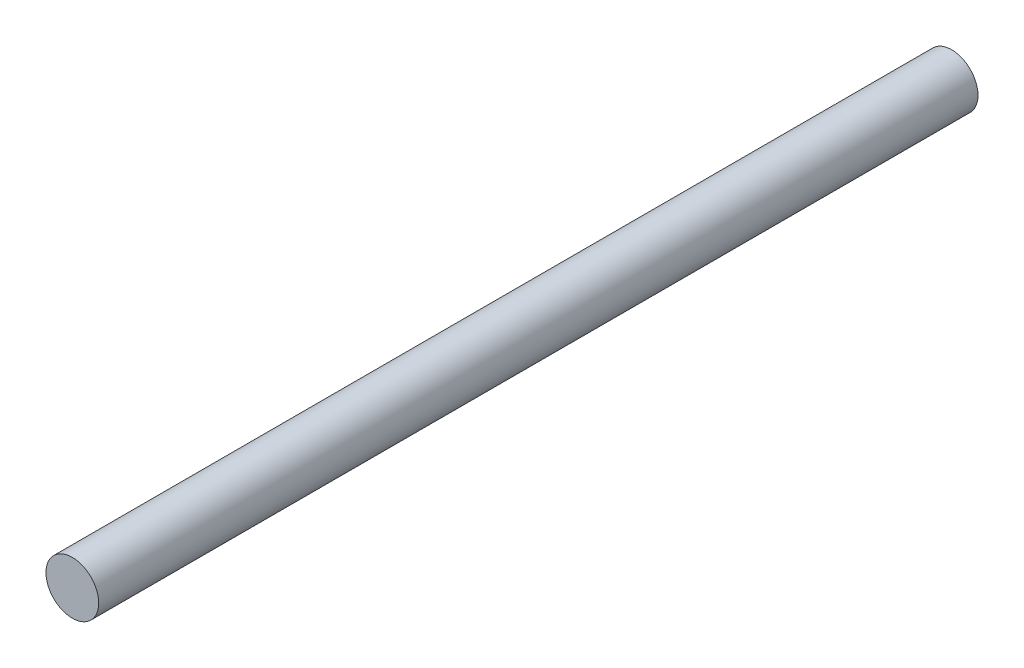
ISO-10303-21;
HEADER;
FILE_DESCRIPTION(('STEP AP214'),'2;1');
FILE_NAME('part.step','',(''),(''),'','','');
FILE_SCHEMA(('AUTOMOTIVE_DESIGN { 1 0 10303 214 1 1 1 1 }'));
ENDSEC;
DATA;
#1=APPLICATION_CONTEXT('core data for automotive mechanical design processes');
#2=APPLICATION_PROTOCOL_DEFINITION('international standard','automotive_design',2000,#1);
#3=PRODUCT_CONTEXT('',#1,'mechanical');
#4=PRODUCT('Part','Part','',(#3));
#5=PRODUCT_RELATED_PRODUCT_CATEGORY('part','',(#4));
#6=PRODUCT_DEFINITION_FORMATION('','',#4);
#7=PRODUCT_DEFINITION_CONTEXT('part definition',#1,'design');
#8=PRODUCT_DEFINITION('design','',#6,#7);
#9=PRODUCT_DEFINITION_SHAPE('','',#8);
#10=(LENGTH_UNIT() NAMED_UNIT(*) SI_UNIT(.MILLI.,.METRE.));
#11=(NAMED_UNIT(*) PLANE_ANGLE_UNIT() SI_UNIT($,.RADIAN.));
#12=(NAMED_UNIT(*) SI_UNIT($,.STERADIAN.) SOLID_ANGLE_UNIT());
#13=UNCERTAINTY_MEASURE_WITH_UNIT(LENGTH_MEASURE(1.E-05),#10,'distance_accuracy_value','');
#14=(GEOMETRIC_REPRESENTATION_CONTEXT(3) GLOBAL_UNCERTAINTY_ASSIGNED_CONTEXT((#13)) GLOBAL_UNIT_ASSIGNED_CONTEXT((#10,
#11,#12)) REPRESENTATION_CONTEXT('',''));
#15=CARTESIAN_POINT('',(0.,0.,0.));
#16=DIRECTION('',(0.,0.,1.));
#17=DIRECTION('',(1.,0.,0.));
#18=AXIS2_PLACEMENT_3D('',#15,#16,#17);
#19=CARTESIAN_POINT('',(0.,0.,500.));
#20=DIRECTION('',(0.,0.,-1.));
#21=DIRECTION('',(-1.,0.,0.));
#22=AXIS2_PLACEMENT_3D('',#19,#20,#21);
#23=CYLINDRICAL_SURFACE('',#22,15.);
#24=CARTESIAN_POINT('',(0.,0.,500.));
#25=DIRECTION('',(0.,0.,1.));
#26=DIRECTION('',(1.,0.,0.));
#27=AXIS2_PLACEMENT_3D('',#24,#25,#26);
#28=CIRCLE('',#27,15.);
#29=CARTESIAN_POINT('',(15.,0.,500.));
#30=VERTEX_POINT('',#29);
#31=EDGE_CURVE('E10',#30,#30,#28,.T.);
#32=ORIENTED_EDGE('',*,*,#31,.F.);
#33=EDGE_LOOP('',(#32));
#34=FACE_BOUND('',#33,.T.);
#35=CARTESIAN_POINT('',(0.,0.,0.));
#36=DIRECTION('',(0.,0.,1.));
#37=DIRECTION('',(1.,0.,0.));
#38=AXIS2_PLACEMENT_3D('',#35,#36,#37);
#39=CIRCLE('',#38,15.);
#40=CARTESIAN_POINT('',(15.,0.,0.));
#41=VERTEX_POINT('',#40);
#42=EDGE_CURVE('E36',#41,#41,#39,.T.);
#43=ORIENTED_EDGE('',*,*,#42,.T.);
#44=EDGE_LOOP('',(#43));
#45=FACE_BOUND('',#44,.T.);
#46=ADVANCED_FACE('F33',(#34,#45),#23,.T.);
#47=CARTESIAN_POINT('',(0.,0.,500.));
#48=DIRECTION('',(0.,0.,1.));
#49=DIRECTION('',(1.,0.,0.));
#50=AXIS2_PLACEMENT_3D('',#47,#48,#49);
#51=PLANE('',#50);
#52=ORIENTED_EDGE('',*,*,#31,.T.);
#53=EDGE_LOOP('',(#52));
#54=FACE_BOUND('',#53,.T.);
#55=ADVANCED_FACE('F48',(#54),#51,.T.);
#56=CARTESIAN_POINT('',(0.,0.,0.));
#57=DIRECTION('',(0.,0.,1.));
#58=DIRECTION('',(1.,0.,0.));
#59=AXIS2_PLACEMENT_3D('',#56,#57,#58);
#60=PLANE('',#59);
#61=ORIENTED_EDGE('',*,*,#42,.F.);
#62=EDGE_LOOP('',(#61));
#63=FACE_BOUND('',#62,.T.);
#64=ADVANCED_FACE('F46',(#63),#60,.F.);
#65=CLOSED_SHELL('',(#46,#55,#64));
#66=MANIFOLD_SOLID_BREP('B2',#65);
#67=ADVANCED_BREP_SHAPE_REPRESENTATION('',(#18,#66),#14);
#68=SHAPE_DEFINITION_REPRESENTATION(#9,#67);
ENDSEC;
END-ISO-10303-21;
